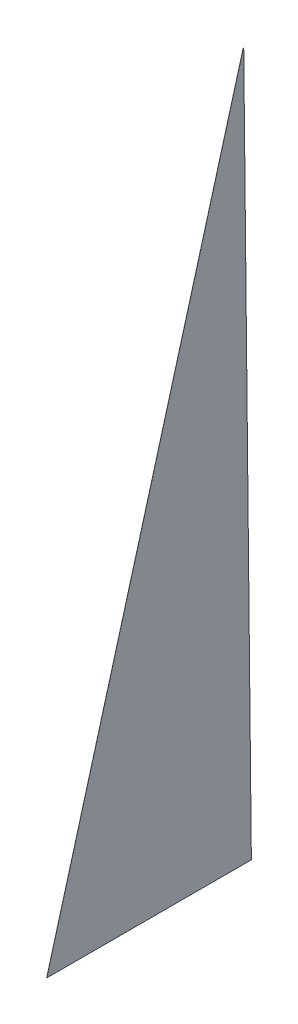
ISO-10303-21;
HEADER;
FILE_DESCRIPTION(('STEP AP214'),'2;1');
FILE_NAME('part.step','',(''),(''),'','','');
FILE_SCHEMA(('AUTOMOTIVE_DESIGN { 1 0 10303 214 1 1 1 1 }'));
ENDSEC;
DATA;
#1=APPLICATION_CONTEXT('core data for automotive mechanical design processes');
#2=APPLICATION_PROTOCOL_DEFINITION('international standard','automotive_design',2000,#1);
#3=PRODUCT_CONTEXT('',#1,'mechanical');
#4=PRODUCT('Part','Part','',(#3));
#5=PRODUCT_RELATED_PRODUCT_CATEGORY('part','',(#4));
#6=PRODUCT_DEFINITION_FORMATION('','',#4);
#7=PRODUCT_DEFINITION_CONTEXT('part definition',#1,'design');
#8=PRODUCT_DEFINITION('design','',#6,#7);
#9=PRODUCT_DEFINITION_SHAPE('','',#8);
#10=(LENGTH_UNIT() NAMED_UNIT(*) SI_UNIT(.MILLI.,.METRE.));
#11=(NAMED_UNIT(*) PLANE_ANGLE_UNIT() SI_UNIT($,.RADIAN.));
#12=(NAMED_UNIT(*) SI_UNIT($,.STERADIAN.) SOLID_ANGLE_UNIT());
#13=UNCERTAINTY_MEASURE_WITH_UNIT(LENGTH_MEASURE(1.E-05),#10,'distance_accuracy_value','');
#14=(GEOMETRIC_REPRESENTATION_CONTEXT(3) GLOBAL_UNCERTAINTY_ASSIGNED_CONTEXT((#13)) GLOBAL_UNIT_ASSIGNED_CONTEXT((#10,
#11,#12)) REPRESENTATION_CONTEXT('',''));
#15=CARTESIAN_POINT('',(0.,0.,0.));
#16=DIRECTION('',(0.,0.,1.));
#17=DIRECTION('',(1.,0.,0.));
#18=AXIS2_PLACEMENT_3D('',#15,#16,#17);
#19=CARTESIAN_POINT('',(0.064008,0.,-175.));
#20=DIRECTION('',(0.,1.,0.));
#21=DIRECTION('',(0.,0.,1.));
#22=AXIS2_PLACEMENT_3D('',#19,#20,#21);
#23=PLANE('',#22);
#24=DIRECTION('',(0.,0.,-1.));
#25=VECTOR('',#24,1.);
#26=CARTESIAN_POINT('',(0.,0.,-175.));
#27=LINE('',#26,#25);
#28=CARTESIAN_POINT('',(0.,0.,0.));
#29=VERTEX_POINT('',#28);
#30=CARTESIAN_POINT('',(0.,0.,-175.));
#31=VERTEX_POINT('',#30);
#32=EDGE_CURVE('E80',#29,#31,#27,.T.);
#33=ORIENTED_EDGE('',*,*,#32,.T.);
#34=DIRECTION('',(-1.,0.,0.));
#35=VECTOR('',#34,1.);
#36=CARTESIAN_POINT('',(0.064008,0.,-175.));
#37=LINE('',#36,#35);
#38=CARTESIAN_POINT('',(0.064008,0.,-175.));
#39=VERTEX_POINT('',#38);
#40=EDGE_CURVE('E11',#39,#31,#37,.T.);
#41=ORIENTED_EDGE('',*,*,#40,.F.);
#42=DIRECTION('',(0.,0.,-1.));
#43=VECTOR('',#42,1.);
#44=CARTESIAN_POINT('',(0.064008,0.,-175.));
#45=LINE('',#44,#43);
#46=CARTESIAN_POINT('',(0.064008,0.,0.));
#47=VERTEX_POINT('',#46);
#48=EDGE_CURVE('E73',#47,#39,#45,.T.);
#49=ORIENTED_EDGE('',*,*,#48,.F.);
#50=DIRECTION('',(-1.,0.,0.));
#51=VECTOR('',#50,1.);
#52=CARTESIAN_POINT('',(0.064008,0.,0.));
#53=LINE('',#52,#51);
#54=EDGE_CURVE('E81',#47,#29,#53,.T.);
#55=ORIENTED_EDGE('',*,*,#54,.T.);
#56=EDGE_LOOP('',(#33,#41,#49,#55));
#57=FACE_BOUND('',#56,.T.);
#58=ADVANCED_FACE('F33',(#57),#23,.F.);
#59=CARTESIAN_POINT('',(0.064008,605.88,-168.45));
#60=DIRECTION('',(0.,-0.0108100899166908,0.999941569270922));
#61=DIRECTION('',(0.,-0.999941569270922,-0.0108100899166908));
#62=AXIS2_PLACEMENT_3D('',#59,#60,#61);
#63=PLANE('',#62);
#64=DIRECTION('',(0.,0.999941569270922,0.0108100899166908));
#65=VECTOR('',#64,1.);
#66=CARTESIAN_POINT('',(0.,605.88,-168.45));
#67=LINE('',#66,#65);
#68=CARTESIAN_POINT('',(0.,605.88,-168.45));
#69=VERTEX_POINT('',#68);
#70=EDGE_CURVE('E61',#31,#69,#67,.T.);
#71=ORIENTED_EDGE('',*,*,#70,.T.);
#72=DIRECTION('',(-1.,0.,0.));
#73=VECTOR('',#72,1.);
#74=CARTESIAN_POINT('',(0.064008,605.88,-168.45));
#75=LINE('',#74,#73);
#76=CARTESIAN_POINT('',(0.064008,605.88,-168.45));
#77=VERTEX_POINT('',#76);
#78=EDGE_CURVE('E41',#77,#69,#75,.T.);
#79=ORIENTED_EDGE('',*,*,#78,.F.);
#80=DIRECTION('',(0.,0.999941569270922,0.0108100899166908));
#81=VECTOR('',#80,1.);
#82=CARTESIAN_POINT('',(0.064008,605.88,-168.45));
#83=LINE('',#82,#81);
#84=EDGE_CURVE('E69',#39,#77,#83,.T.);
#85=ORIENTED_EDGE('',*,*,#84,.F.);
#86=ORIENTED_EDGE('',*,*,#40,.T.);
#87=EDGE_LOOP('',(#71,#79,#85,#86));
#88=FACE_BOUND('',#87,.T.);
#89=ADVANCED_FACE('F70',(#88),#63,.F.);
#90=CARTESIAN_POINT('',(0.064008,0.,0.));
#91=DIRECTION('',(0.,-0.267865296823061,-0.963456373043374));
#92=DIRECTION('',(0.,0.963456373043374,-0.267865296823061));
#93=AXIS2_PLACEMENT_3D('',#90,#91,#92);
#94=PLANE('',#93);
#95=DIRECTION('',(0.,-0.963456373043374,0.267865296823061));
#96=VECTOR('',#95,1.);
#97=CARTESIAN_POINT('',(0.,0.,0.));
#98=LINE('',#97,#96);
#99=EDGE_CURVE('E66',#69,#29,#98,.T.);
#100=ORIENTED_EDGE('',*,*,#99,.T.);
#101=ORIENTED_EDGE('',*,*,#54,.F.);
#102=DIRECTION('',(0.,-0.963456373043374,0.267865296823061));
#103=VECTOR('',#102,1.);
#104=CARTESIAN_POINT('',(0.064008,0.,0.));
#105=LINE('',#104,#103);
#106=EDGE_CURVE('E49',#77,#47,#105,.T.);
#107=ORIENTED_EDGE('',*,*,#106,.F.);
#108=ORIENTED_EDGE('',*,*,#78,.T.);
#109=EDGE_LOOP('',(#100,#101,#107,#108));
#110=FACE_BOUND('',#109,.T.);
#111=ADVANCED_FACE('F88',(#110),#94,.F.);
#112=CARTESIAN_POINT('',(0.064008,0.,0.));
#113=DIRECTION('',(1.,0.,0.));
#114=DIRECTION('',(0.,0.,-1.));
#115=AXIS2_PLACEMENT_3D('',#112,#113,#114);
#116=PLANE('',#115);
#117=ORIENTED_EDGE('',*,*,#48,.T.);
#118=ORIENTED_EDGE('',*,*,#84,.T.);
#119=ORIENTED_EDGE('',*,*,#106,.T.);
#120=EDGE_LOOP('',(#117,#118,#119));
#121=FACE_BOUND('',#120,.T.);
#122=ADVANCED_FACE('F76',(#121),#116,.T.);
#123=CARTESIAN_POINT('',(0.,0.,0.));
#124=DIRECTION('',(1.,0.,0.));
#125=DIRECTION('',(0.,0.,-1.));
#126=AXIS2_PLACEMENT_3D('',#123,#124,#125);
#127=PLANE('',#126);
#128=ORIENTED_EDGE('',*,*,#32,.F.);
#129=ORIENTED_EDGE('',*,*,#99,.F.);
#130=ORIENTED_EDGE('',*,*,#70,.F.);
#131=EDGE_LOOP('',(#128,#129,#130));
#132=FACE_BOUND('',#131,.T.);
#133=ADVANCED_FACE('F89',(#132),#127,.F.);
#134=CLOSED_SHELL('',(#58,#89,#111,#122,#133));
#135=MANIFOLD_SOLID_BREP('B2',#134);
#136=ADVANCED_BREP_SHAPE_REPRESENTATION('',(#18,#135),#14);
#137=SHAPE_DEFINITION_REPRESENTATION(#9,#136);
ENDSEC;
END-ISO-10303-21;
